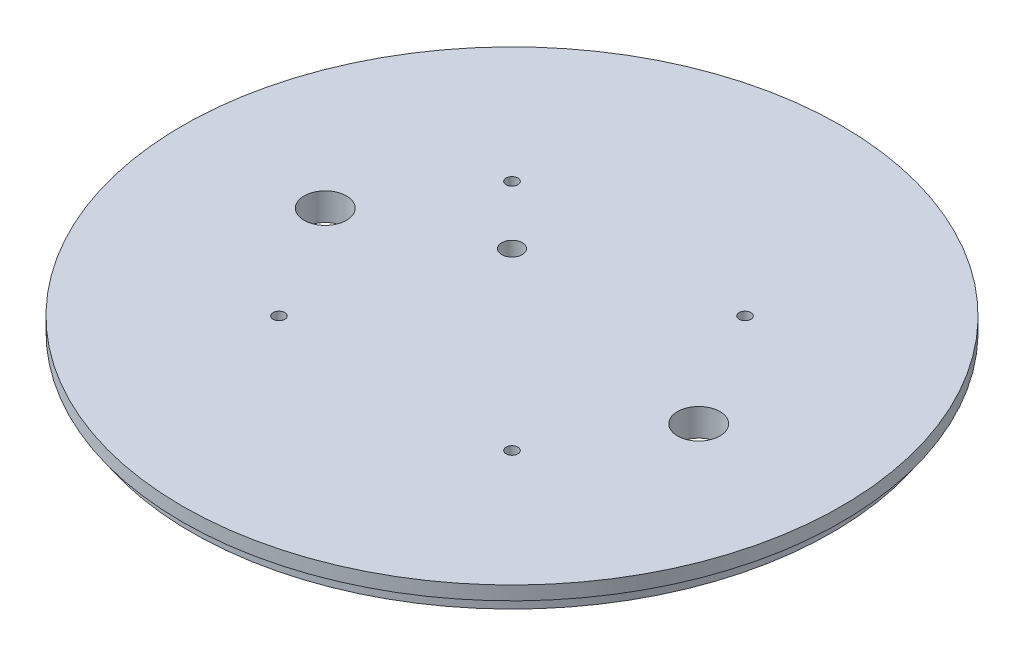
ISO-10303-21;
HEADER;
FILE_DESCRIPTION(('STEP AP214'),'2;1');
FILE_NAME('part.step','',(''),(''),'','','');
FILE_SCHEMA(('AUTOMOTIVE_DESIGN { 1 0 10303 214 1 1 1 1 }'));
ENDSEC;
DATA;
#1=APPLICATION_CONTEXT('core data for automotive mechanical design processes');
#2=APPLICATION_PROTOCOL_DEFINITION('international standard','automotive_design',2000,#1);
#3=PRODUCT_CONTEXT('',#1,'mechanical');
#4=PRODUCT('Part','Part','',(#3));
#5=PRODUCT_RELATED_PRODUCT_CATEGORY('part','',(#4));
#6=PRODUCT_DEFINITION_FORMATION('','',#4);
#7=PRODUCT_DEFINITION_CONTEXT('part definition',#1,'design');
#8=PRODUCT_DEFINITION('design','',#6,#7);
#9=PRODUCT_DEFINITION_SHAPE('','',#8);
#10=(LENGTH_UNIT() NAMED_UNIT(*) SI_UNIT(.MILLI.,.METRE.));
#11=(NAMED_UNIT(*) PLANE_ANGLE_UNIT() SI_UNIT($,.RADIAN.));
#12=(NAMED_UNIT(*) SI_UNIT($,.STERADIAN.) SOLID_ANGLE_UNIT());
#13=UNCERTAINTY_MEASURE_WITH_UNIT(LENGTH_MEASURE(1.E-05),#10,'distance_accuracy_value','');
#14=(GEOMETRIC_REPRESENTATION_CONTEXT(3) GLOBAL_UNCERTAINTY_ASSIGNED_CONTEXT((#13)) GLOBAL_UNIT_ASSIGNED_CONTEXT((#10,
#11,#12)) REPRESENTATION_CONTEXT('',''));
#15=CARTESIAN_POINT('',(0.,0.,0.));
#16=DIRECTION('',(0.,0.,1.));
#17=DIRECTION('',(1.,0.,0.));
#18=AXIS2_PLACEMENT_3D('',#15,#16,#17);
#19=CARTESIAN_POINT('',(0.,6.35,0.));
#20=DIRECTION('',(0.,-1.,0.));
#21=DIRECTION('',(0.,0.,-1.));
#22=AXIS2_PLACEMENT_3D('',#19,#20,#21);
#23=CYLINDRICAL_SURFACE('',#22,76.2);
#24=CARTESIAN_POINT('',(0.,6.35,0.));
#25=DIRECTION('',(0.,1.,0.));
#26=DIRECTION('',(0.,0.,1.));
#27=AXIS2_PLACEMENT_3D('',#24,#25,#26);
#28=CIRCLE('',#27,76.2);
#29=CARTESIAN_POINT('',(0.,6.35,76.2));
#30=VERTEX_POINT('',#29);
#31=EDGE_CURVE('E197',#30,#30,#28,.T.);
#32=ORIENTED_EDGE('',*,*,#31,.F.);
#33=EDGE_LOOP('',(#32));
#34=FACE_BOUND('',#33,.T.);
#35=CARTESIAN_POINT('',(0.,3.175,0.));
#36=DIRECTION('',(0.,-1.,0.));
#37=DIRECTION('',(0.,0.,-1.));
#38=AXIS2_PLACEMENT_3D('',#35,#36,#37);
#39=CIRCLE('',#38,76.2);
#40=CARTESIAN_POINT('',(0.,3.175,-76.2));
#41=VERTEX_POINT('',#40);
#42=EDGE_CURVE('E176',#41,#41,#39,.T.);
#43=ORIENTED_EDGE('',*,*,#42,.F.);
#44=EDGE_LOOP('',(#43));
#45=FACE_BOUND('',#44,.T.);
#46=ADVANCED_FACE('F41',(#34,#45),#23,.T.);
#47=CARTESIAN_POINT('',(0.,0.,0.));
#48=DIRECTION('',(0.,1.,0.));
#49=DIRECTION('',(0.,0.,1.));
#50=AXIS2_PLACEMENT_3D('',#47,#48,#49);
#51=PLANE('',#50);
#52=DIRECTION('',(0.,0.,-1.));
#53=VECTOR('',#52,1.);
#54=CARTESIAN_POINT('',(3.23850000000001,0.,0.));
#55=LINE('',#54,#53);
#56=CARTESIAN_POINT('',(3.23850000000001,0.,-13.97));
#57=VERTEX_POINT('',#56);
#58=CARTESIAN_POINT('',(3.23850000000001,0.,-34.798));
#59=VERTEX_POINT('',#58);
#60=EDGE_CURVE('E50',#57,#59,#55,.T.);
#61=ORIENTED_EDGE('',*,*,#60,.T.);
#62=CARTESIAN_POINT('',(0.,0.,-34.798));
#63=DIRECTION('',(0.,1.,0.));
#64=DIRECTION('',(0.,0.,1.));
#65=AXIS2_PLACEMENT_3D('',#62,#63,#64);
#66=CIRCLE('',#65,3.2385);
#67=CARTESIAN_POINT('',(-3.23849999999999,0.,-34.798));
#68=VERTEX_POINT('',#67);
#69=EDGE_CURVE('E11',#59,#68,#66,.T.);
#70=ORIENTED_EDGE('',*,*,#69,.T.);
#71=DIRECTION('',(0.,0.,1.));
#72=VECTOR('',#71,1.);
#73=CARTESIAN_POINT('',(-3.23849999999999,0.,0.));
#74=LINE('',#73,#72);
#75=CARTESIAN_POINT('',(-3.23849999999999,0.,-13.97));
#76=VERTEX_POINT('',#75);
#77=EDGE_CURVE('E110',#68,#76,#74,.T.);
#78=ORIENTED_EDGE('',*,*,#77,.T.);
#79=CARTESIAN_POINT('',(0.,0.,-13.97));
#80=DIRECTION('',(0.,1.,0.));
#81=DIRECTION('',(0.,0.,1.));
#82=AXIS2_PLACEMENT_3D('',#79,#80,#81);
#83=CIRCLE('',#82,3.2385);
#84=EDGE_CURVE('E261',#76,#57,#83,.T.);
#85=ORIENTED_EDGE('',*,*,#84,.T.);
#86=EDGE_LOOP('',(#61,#70,#78,#85));
#87=FACE_BOUND('',#86,.T.);
#88=DIRECTION('',(0.,0.,1.));
#89=VECTOR('',#88,1.);
#90=CARTESIAN_POINT('',(-3.23850000000005,0.,0.));
#91=LINE('',#90,#89);
#92=CARTESIAN_POINT('',(-3.23850000000005,0.,13.97));
#93=VERTEX_POINT('',#92);
#94=CARTESIAN_POINT('',(-3.23850000000005,0.,34.798));
#95=VERTEX_POINT('',#94);
#96=EDGE_CURVE('E251',#93,#95,#91,.T.);
#97=ORIENTED_EDGE('',*,*,#96,.T.);
#98=CARTESIAN_POINT('',(0.,0.,34.798));
#99=DIRECTION('',(0.,1.,0.));
#100=DIRECTION('',(0.,0.,1.));
#101=AXIS2_PLACEMENT_3D('',#98,#99,#100);
#102=CIRCLE('',#101,3.2385);
#103=CARTESIAN_POINT('',(3.23849999999995,0.,34.798));
#104=VERTEX_POINT('',#103);
#105=EDGE_CURVE('E255',#95,#104,#102,.T.);
#106=ORIENTED_EDGE('',*,*,#105,.T.);
#107=DIRECTION('',(0.,0.,-1.));
#108=VECTOR('',#107,1.);
#109=CARTESIAN_POINT('',(3.23849999999995,0.,0.));
#110=LINE('',#109,#108);
#111=CARTESIAN_POINT('',(3.23849999999995,0.,13.97));
#112=VERTEX_POINT('',#111);
#113=EDGE_CURVE('E217',#104,#112,#110,.T.);
#114=ORIENTED_EDGE('',*,*,#113,.T.);
#115=CARTESIAN_POINT('',(0.,0.,13.97));
#116=DIRECTION('',(0.,1.,0.));
#117=DIRECTION('',(0.,0.,1.));
#118=AXIS2_PLACEMENT_3D('',#115,#116,#117);
#119=CIRCLE('',#118,3.2385);
#120=EDGE_CURVE('E247',#112,#93,#119,.T.);
#121=ORIENTED_EDGE('',*,*,#120,.T.);
#122=EDGE_LOOP('',(#97,#106,#114,#121));
#123=FACE_BOUND('',#122,.T.);
#124=CARTESIAN_POINT('',(-26.9407683632074,0.,26.9407683632075));
#125=DIRECTION('',(0.,1.,0.));
#126=DIRECTION('',(0.,0.,1.));
#127=AXIS2_PLACEMENT_3D('',#124,#125,#126);
#128=CIRCLE('',#127,1.3589);
#129=CARTESIAN_POINT('',(-26.9407683632074,0.,28.2996683632075));
#130=VERTEX_POINT('',#129);
#131=EDGE_CURVE('E189',#130,#130,#128,.F.);
#132=ORIENTED_EDGE('',*,*,#131,.F.);
#133=EDGE_LOOP('',(#132));
#134=FACE_BOUND('',#133,.T.);
#135=CARTESIAN_POINT('',(-13.4703841816037,0.,-13.4703841816038));
#136=DIRECTION('',(0.,1.,0.));
#137=DIRECTION('',(0.,0.,1.));
#138=AXIS2_PLACEMENT_3D('',#135,#136,#137);
#139=CIRCLE('',#138,2.38125);
#140=CARTESIAN_POINT('',(-13.4703841816037,0.,-11.0891341816038));
#141=VERTEX_POINT('',#140);
#142=EDGE_CURVE('E237',#141,#141,#139,.T.);
#143=ORIENTED_EDGE('',*,*,#142,.T.);
#144=EDGE_LOOP('',(#143));
#145=FACE_BOUND('',#144,.T.);
#146=CARTESIAN_POINT('',(-43.18,0.,0.));
#147=DIRECTION('',(0.,1.,0.));
#148=DIRECTION('',(0.,0.,1.));
#149=AXIS2_PLACEMENT_3D('',#146,#147,#148);
#150=CIRCLE('',#149,4.9022);
#151=CARTESIAN_POINT('',(-43.18,0.,4.9022));
#152=VERTEX_POINT('',#151);
#153=EDGE_CURVE('E233',#152,#152,#150,.F.);
#154=ORIENTED_EDGE('',*,*,#153,.F.);
#155=EDGE_LOOP('',(#154));
#156=FACE_BOUND('',#155,.T.);
#157=CARTESIAN_POINT('',(43.18,0.,0.));
#158=DIRECTION('',(0.,1.,0.));
#159=DIRECTION('',(0.,0.,1.));
#160=AXIS2_PLACEMENT_3D('',#157,#158,#159);
#161=CIRCLE('',#160,4.9022);
#162=CARTESIAN_POINT('',(43.18,0.,4.9022));
#163=VERTEX_POINT('',#162);
#164=EDGE_CURVE('E229',#163,#163,#161,.T.);
#165=ORIENTED_EDGE('',*,*,#164,.T.);
#166=EDGE_LOOP('',(#165));
#167=FACE_BOUND('',#166,.T.);
#168=CARTESIAN_POINT('',(-26.9407683632074,0.,-26.9407683632075));
#169=DIRECTION('',(0.,1.,0.));
#170=DIRECTION('',(0.,0.,1.));
#171=AXIS2_PLACEMENT_3D('',#168,#169,#170);
#172=CIRCLE('',#171,1.3589);
#173=CARTESIAN_POINT('',(-26.9407683632074,0.,-25.5818683632075));
#174=VERTEX_POINT('',#173);
#175=EDGE_CURVE('E225',#174,#174,#172,.T.);
#176=ORIENTED_EDGE('',*,*,#175,.T.);
#177=EDGE_LOOP('',(#176));
#178=FACE_BOUND('',#177,.T.);
#179=CARTESIAN_POINT('',(26.9407683632076,0.,26.9407683632073));
#180=DIRECTION('',(0.,1.,0.));
#181=DIRECTION('',(0.,0.,1.));
#182=AXIS2_PLACEMENT_3D('',#179,#180,#181);
#183=CIRCLE('',#182,1.3589);
#184=CARTESIAN_POINT('',(26.9407683632076,0.,28.2996683632073));
#185=VERTEX_POINT('',#184);
#186=EDGE_CURVE('E221',#185,#185,#183,.F.);
#187=ORIENTED_EDGE('',*,*,#186,.F.);
#188=EDGE_LOOP('',(#187));
#189=FACE_BOUND('',#188,.T.);
#190=CARTESIAN_POINT('',(26.9407683632076,0.,-26.9407683632073));
#191=DIRECTION('',(0.,1.,0.));
#192=DIRECTION('',(0.,0.,1.));
#193=AXIS2_PLACEMENT_3D('',#190,#191,#192);
#194=CIRCLE('',#193,1.3589);
#195=CARTESIAN_POINT('',(26.9407683632076,0.,-25.5818683632073));
#196=VERTEX_POINT('',#195);
#197=EDGE_CURVE('E183',#196,#196,#194,.T.);
#198=ORIENTED_EDGE('',*,*,#197,.T.);
#199=EDGE_LOOP('',(#198));
#200=FACE_BOUND('',#199,.T.);
#201=CARTESIAN_POINT('',(0.,0.,0.));
#202=DIRECTION('',(0.,-1.,0.));
#203=DIRECTION('',(0.,0.,-1.));
#204=AXIS2_PLACEMENT_3D('',#201,#202,#203);
#205=CIRCLE('',#204,74.041);
#206=CARTESIAN_POINT('',(0.,0.,-74.041));
#207=VERTEX_POINT('',#206);
#208=EDGE_CURVE('E144',#207,#207,#205,.T.);
#209=ORIENTED_EDGE('',*,*,#208,.T.);
#210=EDGE_LOOP('',(#209));
#211=FACE_BOUND('',#210,.T.);
#212=ADVANCED_FACE('F268',(#87,#123,#134,#145,#156,#167,#178,#189,#200,#211),#51,.F.);
#213=CARTESIAN_POINT('',(-13.4703841816037,6.35,-13.4703841816038));
#214=DIRECTION('',(0.,-1.,0.));
#215=DIRECTION('',(0.,0.,-1.));
#216=AXIS2_PLACEMENT_3D('',#213,#214,#215);
#217=CYLINDRICAL_SURFACE('',#216,2.38125);
#218=CARTESIAN_POINT('',(-13.4703841816037,6.35,-13.4703841816038));
#219=DIRECTION('',(0.,1.,0.));
#220=DIRECTION('',(0.,0.,1.));
#221=AXIS2_PLACEMENT_3D('',#218,#219,#220);
#222=CIRCLE('',#221,2.38125);
#223=CARTESIAN_POINT('',(-13.4703841816037,6.35,-11.0891341816038));
#224=VERTEX_POINT('',#223);
#225=EDGE_CURVE('E209',#224,#224,#222,.T.);
#226=ORIENTED_EDGE('',*,*,#225,.T.);
#227=EDGE_LOOP('',(#226));
#228=FACE_BOUND('',#227,.T.);
#229=ORIENTED_EDGE('',*,*,#142,.F.);
#230=EDGE_LOOP('',(#229));
#231=FACE_BOUND('',#230,.T.);
#232=ADVANCED_FACE('F289',(#228,#231),#217,.F.);
#233=CARTESIAN_POINT('',(-43.18,6.35,0.));
#234=DIRECTION('',(0.,-1.,0.));
#235=DIRECTION('',(0.,0.,-1.));
#236=AXIS2_PLACEMENT_3D('',#233,#234,#235);
#237=CYLINDRICAL_SURFACE('',#236,4.9022);
#238=CARTESIAN_POINT('',(-43.18,6.35,0.));
#239=DIRECTION('',(0.,1.,0.));
#240=DIRECTION('',(0.,0.,1.));
#241=AXIS2_PLACEMENT_3D('',#238,#239,#240);
#242=CIRCLE('',#241,4.9022);
#243=CARTESIAN_POINT('',(-43.18,6.35,4.9022));
#244=VERTEX_POINT('',#243);
#245=EDGE_CURVE('E205',#244,#244,#242,.F.);
#246=ORIENTED_EDGE('',*,*,#245,.F.);
#247=EDGE_LOOP('',(#246));
#248=FACE_BOUND('',#247,.T.);
#249=ORIENTED_EDGE('',*,*,#153,.T.);
#250=EDGE_LOOP('',(#249));
#251=FACE_BOUND('',#250,.T.);
#252=ADVANCED_FACE('F342',(#248,#251),#237,.F.);
#253=CARTESIAN_POINT('',(43.18,6.35,0.));
#254=DIRECTION('',(0.,-1.,0.));
#255=DIRECTION('',(0.,0.,-1.));
#256=AXIS2_PLACEMENT_3D('',#253,#254,#255);
#257=CYLINDRICAL_SURFACE('',#256,4.9022);
#258=CARTESIAN_POINT('',(43.18,6.35,0.));
#259=DIRECTION('',(0.,1.,0.));
#260=DIRECTION('',(0.,0.,1.));
#261=AXIS2_PLACEMENT_3D('',#258,#259,#260);
#262=CIRCLE('',#261,4.9022);
#263=CARTESIAN_POINT('',(43.18,6.35,4.9022));
#264=VERTEX_POINT('',#263);
#265=EDGE_CURVE('E201',#264,#264,#262,.T.);
#266=ORIENTED_EDGE('',*,*,#265,.T.);
#267=EDGE_LOOP('',(#266));
#268=FACE_BOUND('',#267,.T.);
#269=ORIENTED_EDGE('',*,*,#164,.F.);
#270=EDGE_LOOP('',(#269));
#271=FACE_BOUND('',#270,.T.);
#272=ADVANCED_FACE('F295',(#268,#271),#257,.F.);
#273=CARTESIAN_POINT('',(-26.9407683632074,6.35,-26.9407683632075));
#274=DIRECTION('',(0.,-1.,0.));
#275=DIRECTION('',(0.,0.,-1.));
#276=AXIS2_PLACEMENT_3D('',#273,#274,#275);
#277=CYLINDRICAL_SURFACE('',#276,1.3589);
#278=CARTESIAN_POINT('',(-26.9407683632074,6.35,-26.9407683632075));
#279=DIRECTION('',(0.,1.,0.));
#280=DIRECTION('',(0.,0.,1.));
#281=AXIS2_PLACEMENT_3D('',#278,#279,#280);
#282=CIRCLE('',#281,1.3589);
#283=CARTESIAN_POINT('',(-26.9407683632074,6.35,-25.5818683632075));
#284=VERTEX_POINT('',#283);
#285=EDGE_CURVE('E193',#284,#284,#282,.T.);
#286=ORIENTED_EDGE('',*,*,#285,.T.);
#287=EDGE_LOOP('',(#286));
#288=FACE_BOUND('',#287,.T.);
#289=ORIENTED_EDGE('',*,*,#175,.F.);
#290=EDGE_LOOP('',(#289));
#291=FACE_BOUND('',#290,.T.);
#292=ADVANCED_FACE('F297',(#288,#291),#277,.F.);
#293=CARTESIAN_POINT('',(26.9407683632076,6.35,26.9407683632073));
#294=DIRECTION('',(0.,-1.,0.));
#295=DIRECTION('',(0.,0.,-1.));
#296=AXIS2_PLACEMENT_3D('',#293,#294,#295);
#297=CYLINDRICAL_SURFACE('',#296,1.3589);
#298=CARTESIAN_POINT('',(26.9407683632076,6.35,26.9407683632073));
#299=DIRECTION('',(0.,1.,0.));
#300=DIRECTION('',(0.,0.,1.));
#301=AXIS2_PLACEMENT_3D('',#298,#299,#300);
#302=CIRCLE('',#301,1.3589);
#303=CARTESIAN_POINT('',(26.9407683632076,6.35,28.2996683632073));
#304=VERTEX_POINT('',#303);
#305=EDGE_CURVE('E188',#304,#304,#302,.F.);
#306=ORIENTED_EDGE('',*,*,#305,.F.);
#307=EDGE_LOOP('',(#306));
#308=FACE_BOUND('',#307,.T.);
#309=ORIENTED_EDGE('',*,*,#186,.T.);
#310=EDGE_LOOP('',(#309));
#311=FACE_BOUND('',#310,.T.);
#312=ADVANCED_FACE('F299',(#308,#311),#297,.F.);
#313=CARTESIAN_POINT('',(26.9407683632076,6.35,-26.9407683632073));
#314=DIRECTION('',(0.,-1.,0.));
#315=DIRECTION('',(0.,0.,-1.));
#316=AXIS2_PLACEMENT_3D('',#313,#314,#315);
#317=CYLINDRICAL_SURFACE('',#316,1.3589);
#318=CARTESIAN_POINT('',(26.9407683632076,6.35,-26.9407683632073));
#319=DIRECTION('',(0.,1.,0.));
#320=DIRECTION('',(0.,0.,1.));
#321=AXIS2_PLACEMENT_3D('',#318,#319,#320);
#322=CIRCLE('',#321,1.3589);
#323=CARTESIAN_POINT('',(26.9407683632076,6.35,-25.5818683632073));
#324=VERTEX_POINT('',#323);
#325=EDGE_CURVE('E184',#324,#324,#322,.T.);
#326=ORIENTED_EDGE('',*,*,#325,.T.);
#327=EDGE_LOOP('',(#326));
#328=FACE_BOUND('',#327,.T.);
#329=ORIENTED_EDGE('',*,*,#197,.F.);
#330=EDGE_LOOP('',(#329));
#331=FACE_BOUND('',#330,.T.);
#332=ADVANCED_FACE('F43',(#328,#331),#317,.F.);
#333=CARTESIAN_POINT('',(-26.9407683632074,6.35,26.9407683632075));
#334=DIRECTION('',(0.,-1.,0.));
#335=DIRECTION('',(0.,0.,-1.));
#336=AXIS2_PLACEMENT_3D('',#333,#334,#335);
#337=CYLINDRICAL_SURFACE('',#336,1.3589);
#338=CARTESIAN_POINT('',(-26.9407683632074,6.35,26.9407683632075));
#339=DIRECTION('',(0.,1.,0.));
#340=DIRECTION('',(0.,0.,1.));
#341=AXIS2_PLACEMENT_3D('',#338,#339,#340);
#342=CIRCLE('',#341,1.3589);
#343=CARTESIAN_POINT('',(-26.9407683632074,6.35,28.2996683632075));
#344=VERTEX_POINT('',#343);
#345=EDGE_CURVE('E213',#344,#344,#342,.F.);
#346=ORIENTED_EDGE('',*,*,#345,.F.);
#347=EDGE_LOOP('',(#346));
#348=FACE_BOUND('',#347,.T.);
#349=ORIENTED_EDGE('',*,*,#131,.T.);
#350=EDGE_LOOP('',(#349));
#351=FACE_BOUND('',#350,.T.);
#352=ADVANCED_FACE('F306',(#348,#351),#337,.F.);
#353=CARTESIAN_POINT('',(0.,6.35,0.));
#354=DIRECTION('',(0.,1.,0.));
#355=DIRECTION('',(0.,0.,1.));
#356=AXIS2_PLACEMENT_3D('',#353,#354,#355);
#357=PLANE('',#356);
#358=ORIENTED_EDGE('',*,*,#325,.F.);
#359=EDGE_LOOP('',(#358));
#360=FACE_BOUND('',#359,.T.);
#361=ORIENTED_EDGE('',*,*,#305,.T.);
#362=EDGE_LOOP('',(#361));
#363=FACE_BOUND('',#362,.T.);
#364=ORIENTED_EDGE('',*,*,#285,.F.);
#365=EDGE_LOOP('',(#364));
#366=FACE_BOUND('',#365,.T.);
#367=ORIENTED_EDGE('',*,*,#31,.T.);
#368=EDGE_LOOP('',(#367));
#369=FACE_BOUND('',#368,.T.);
#370=ORIENTED_EDGE('',*,*,#265,.F.);
#371=EDGE_LOOP('',(#370));
#372=FACE_BOUND('',#371,.T.);
#373=ORIENTED_EDGE('',*,*,#245,.T.);
#374=EDGE_LOOP('',(#373));
#375=FACE_BOUND('',#374,.T.);
#376=ORIENTED_EDGE('',*,*,#225,.F.);
#377=EDGE_LOOP('',(#376));
#378=FACE_BOUND('',#377,.T.);
#379=ORIENTED_EDGE('',*,*,#345,.T.);
#380=EDGE_LOOP('',(#379));
#381=FACE_BOUND('',#380,.T.);
#382=ADVANCED_FACE('F330',(#360,#363,#366,#369,#372,#375,#378,#381),#357,.T.);
#383=CARTESIAN_POINT('',(0.,3.175,0.));
#384=DIRECTION('',(0.,-1.,0.));
#385=DIRECTION('',(0.,0.,-1.));
#386=AXIS2_PLACEMENT_3D('',#383,#384,#385);
#387=PLANE('',#386);
#388=CARTESIAN_POINT('',(0.,3.175,0.));
#389=DIRECTION('',(0.,-1.,0.));
#390=DIRECTION('',(0.,0.,-1.));
#391=AXIS2_PLACEMENT_3D('',#388,#389,#390);
#392=CIRCLE('',#391,74.041);
#393=CARTESIAN_POINT('',(0.,3.175,-74.041));
#394=VERTEX_POINT('',#393);
#395=EDGE_CURVE('E172',#394,#394,#392,.T.);
#396=ORIENTED_EDGE('',*,*,#395,.F.);
#397=EDGE_LOOP('',(#396));
#398=FACE_BOUND('',#397,.T.);
#399=ORIENTED_EDGE('',*,*,#42,.T.);
#400=EDGE_LOOP('',(#399));
#401=FACE_BOUND('',#400,.T.);
#402=ADVANCED_FACE('F320',(#398,#401),#387,.T.);
#403=CARTESIAN_POINT('',(0.,3.175,0.));
#404=DIRECTION('',(0.,-1.,0.));
#405=DIRECTION('',(0.,0.,-1.));
#406=AXIS2_PLACEMENT_3D('',#403,#404,#405);
#407=CYLINDRICAL_SURFACE('',#406,74.041);
#408=ORIENTED_EDGE('',*,*,#395,.T.);
#409=EDGE_LOOP('',(#408));
#410=FACE_BOUND('',#409,.T.);
#411=ORIENTED_EDGE('',*,*,#208,.F.);
#412=EDGE_LOOP('',(#411));
#413=FACE_BOUND('',#412,.T.);
#414=ADVANCED_FACE('F317',(#410,#413),#407,.T.);
#415=CARTESIAN_POINT('',(0.,-0.381,34.798));
#416=DIRECTION('',(0.,1.,0.));
#417=DIRECTION('',(0.,0.,1.));
#418=AXIS2_PLACEMENT_3D('',#415,#416,#417);
#419=CYLINDRICAL_SURFACE('',#418,3.2385);
#420=DIRECTION('',(0.,1.,0.));
#421=VECTOR('',#420,1.);
#422=CARTESIAN_POINT('',(-3.23850000000005,-0.381,34.798));
#423=LINE('',#422,#421);
#424=CARTESIAN_POINT('',(-3.23850000000005,3.175,34.798));
#425=VERTEX_POINT('',#424);
#426=EDGE_CURVE('E131',#95,#425,#423,.T.);
#427=ORIENTED_EDGE('',*,*,#426,.T.);
#428=CARTESIAN_POINT('',(0.,3.175,34.798));
#429=DIRECTION('',(0.,1.,0.));
#430=DIRECTION('',(0.,0.,-1.));
#431=AXIS2_PLACEMENT_3D('',#428,#429,#430);
#432=CIRCLE('',#431,3.2385);
#433=CARTESIAN_POINT('',(3.23849999999995,3.175,34.798));
#434=VERTEX_POINT('',#433);
#435=EDGE_CURVE('E150',#425,#434,#432,.T.);
#436=ORIENTED_EDGE('',*,*,#435,.T.);
#437=DIRECTION('',(0.,1.,0.));
#438=VECTOR('',#437,1.);
#439=CARTESIAN_POINT('',(3.23849999999995,-0.381,34.798));
#440=LINE('',#439,#438);
#441=EDGE_CURVE('E164',#104,#434,#440,.T.);
#442=ORIENTED_EDGE('',*,*,#441,.F.);
#443=ORIENTED_EDGE('',*,*,#105,.F.);
#444=EDGE_LOOP('',(#427,#436,#442,#443));
#445=FACE_BOUND('',#444,.T.);
#446=ADVANCED_FACE('F319',(#445),#419,.F.);
#447=CARTESIAN_POINT('',(-3.23850000000005,-0.381,34.798));
#448=DIRECTION('',(-1.,0.,0.));
#449=DIRECTION('',(0.,0.,1.));
#450=AXIS2_PLACEMENT_3D('',#447,#448,#449);
#451=PLANE('',#450);
#452=DIRECTION('',(0.,1.,0.));
#453=VECTOR('',#452,1.);
#454=CARTESIAN_POINT('',(-3.23850000000005,-0.381,13.97));
#455=LINE('',#454,#453);
#456=CARTESIAN_POINT('',(-3.23850000000005,3.175,13.97));
#457=VERTEX_POINT('',#456);
#458=EDGE_CURVE('E135',#93,#457,#455,.T.);
#459=ORIENTED_EDGE('',*,*,#458,.T.);
#460=DIRECTION('',(0.,0.,1.));
#461=VECTOR('',#460,1.);
#462=CARTESIAN_POINT('',(-3.23850000000005,3.175,34.798));
#463=LINE('',#462,#461);
#464=EDGE_CURVE('E161',#457,#425,#463,.T.);
#465=ORIENTED_EDGE('',*,*,#464,.T.);
#466=ORIENTED_EDGE('',*,*,#426,.F.);
#467=ORIENTED_EDGE('',*,*,#96,.F.);
#468=EDGE_LOOP('',(#459,#465,#466,#467));
#469=FACE_BOUND('',#468,.T.);
#470=ADVANCED_FACE('F327',(#469),#451,.F.);
#471=CARTESIAN_POINT('',(0.,-0.381,13.97));
#472=DIRECTION('',(0.,1.,0.));
#473=DIRECTION('',(0.,0.,1.));
#474=AXIS2_PLACEMENT_3D('',#471,#472,#473);
#475=CYLINDRICAL_SURFACE('',#474,3.2385);
#476=DIRECTION('',(0.,1.,0.));
#477=VECTOR('',#476,1.);
#478=CARTESIAN_POINT('',(3.23849999999995,-0.381,13.97));
#479=LINE('',#478,#477);
#480=CARTESIAN_POINT('',(3.23849999999995,3.175,13.97));
#481=VERTEX_POINT('',#480);
#482=EDGE_CURVE('E65',#112,#481,#479,.T.);
#483=ORIENTED_EDGE('',*,*,#482,.T.);
#484=CARTESIAN_POINT('',(0.,3.175,13.97));
#485=DIRECTION('',(0.,1.,0.));
#486=DIRECTION('',(0.,0.,-1.));
#487=AXIS2_PLACEMENT_3D('',#484,#485,#486);
#488=CIRCLE('',#487,3.2385);
#489=EDGE_CURVE('E157',#481,#457,#488,.T.);
#490=ORIENTED_EDGE('',*,*,#489,.T.);
#491=ORIENTED_EDGE('',*,*,#458,.F.);
#492=ORIENTED_EDGE('',*,*,#120,.F.);
#493=EDGE_LOOP('',(#483,#490,#491,#492));
#494=FACE_BOUND('',#493,.T.);
#495=ADVANCED_FACE('F444',(#494),#475,.F.);
#496=CARTESIAN_POINT('',(3.23849999999995,-0.381,34.798));
#497=DIRECTION('',(1.,0.,0.));
#498=DIRECTION('',(0.,0.,-1.));
#499=AXIS2_PLACEMENT_3D('',#496,#497,#498);
#500=PLANE('',#499);
#501=ORIENTED_EDGE('',*,*,#441,.T.);
#502=DIRECTION('',(0.,0.,-1.));
#503=VECTOR('',#502,1.);
#504=CARTESIAN_POINT('',(3.23849999999995,3.175,34.798));
#505=LINE('',#504,#503);
#506=EDGE_CURVE('E154',#434,#481,#505,.T.);
#507=ORIENTED_EDGE('',*,*,#506,.T.);
#508=ORIENTED_EDGE('',*,*,#482,.F.);
#509=ORIENTED_EDGE('',*,*,#113,.F.);
#510=EDGE_LOOP('',(#501,#507,#508,#509));
#511=FACE_BOUND('',#510,.T.);
#512=ADVANCED_FACE('F455',(#511),#500,.F.);
#513=CARTESIAN_POINT('',(0.,3.175,34.798));
#514=DIRECTION('',(0.,-1.,0.));
#515=DIRECTION('',(0.,0.,-1.));
#516=AXIS2_PLACEMENT_3D('',#513,#514,#515);
#517=PLANE('',#516);
#518=ORIENTED_EDGE('',*,*,#435,.F.);
#519=ORIENTED_EDGE('',*,*,#464,.F.);
#520=ORIENTED_EDGE('',*,*,#489,.F.);
#521=ORIENTED_EDGE('',*,*,#506,.F.);
#522=EDGE_LOOP('',(#518,#519,#520,#521));
#523=FACE_BOUND('',#522,.T.);
#524=ADVANCED_FACE('F466',(#523),#517,.T.);
#525=CARTESIAN_POINT('',(0.,-0.381,-34.798));
#526=DIRECTION('',(0.,1.,0.));
#527=DIRECTION('',(0.,0.,1.));
#528=AXIS2_PLACEMENT_3D('',#525,#526,#527);
#529=CYLINDRICAL_SURFACE('',#528,3.2385);
#530=DIRECTION('',(0.,1.,0.));
#531=VECTOR('',#530,1.);
#532=CARTESIAN_POINT('',(3.23850000000001,-0.381,-34.798));
#533=LINE('',#532,#531);
#534=CARTESIAN_POINT('',(3.23850000000001,3.175,-34.798));
#535=VERTEX_POINT('',#534);
#536=EDGE_CURVE('E129',#59,#535,#533,.T.);
#537=ORIENTED_EDGE('',*,*,#536,.T.);
#538=CARTESIAN_POINT('',(0.,3.175,-34.798));
#539=DIRECTION('',(0.,1.,0.));
#540=DIRECTION('',(0.,0.,1.));
#541=AXIS2_PLACEMENT_3D('',#538,#539,#540);
#542=CIRCLE('',#541,3.2385);
#543=CARTESIAN_POINT('',(-3.23849999999999,3.175,-34.798));
#544=VERTEX_POINT('',#543);
#545=EDGE_CURVE('E121',#535,#544,#542,.T.);
#546=ORIENTED_EDGE('',*,*,#545,.T.);
#547=DIRECTION('',(0.,1.,0.));
#548=VECTOR('',#547,1.);
#549=CARTESIAN_POINT('',(-3.23849999999999,-0.381,-34.798));
#550=LINE('',#549,#548);
#551=EDGE_CURVE('E105',#68,#544,#550,.T.);
#552=ORIENTED_EDGE('',*,*,#551,.F.);
#553=ORIENTED_EDGE('',*,*,#69,.F.);
#554=EDGE_LOOP('',(#537,#546,#552,#553));
#555=FACE_BOUND('',#554,.T.);
#556=ADVANCED_FACE('F127',(#555),#529,.F.);
#557=CARTESIAN_POINT('',(3.23850000000001,-0.381,-34.798));
#558=DIRECTION('',(1.,0.,0.));
#559=DIRECTION('',(0.,0.,-1.));
#560=AXIS2_PLACEMENT_3D('',#557,#558,#559);
#561=PLANE('',#560);
#562=DIRECTION('',(0.,1.,0.));
#563=VECTOR('',#562,1.);
#564=CARTESIAN_POINT('',(3.23850000000001,-0.381,-13.97));
#565=LINE('',#564,#563);
#566=CARTESIAN_POINT('',(3.23850000000001,3.175,-13.97));
#567=VERTEX_POINT('',#566);
#568=EDGE_CURVE('E145',#57,#567,#565,.T.);
#569=ORIENTED_EDGE('',*,*,#568,.T.);
#570=DIRECTION('',(0.,0.,-1.));
#571=VECTOR('',#570,1.);
#572=CARTESIAN_POINT('',(3.23850000000001,3.175,-34.798));
#573=LINE('',#572,#571);
#574=EDGE_CURVE('E114',#567,#535,#573,.T.);
#575=ORIENTED_EDGE('',*,*,#574,.T.);
#576=ORIENTED_EDGE('',*,*,#536,.F.);
#577=ORIENTED_EDGE('',*,*,#60,.F.);
#578=EDGE_LOOP('',(#569,#575,#576,#577));
#579=FACE_BOUND('',#578,.T.);
#580=ADVANCED_FACE('F272',(#579),#561,.F.);
#581=CARTESIAN_POINT('',(0.,-0.381,-13.97));
#582=DIRECTION('',(0.,1.,0.));
#583=DIRECTION('',(0.,0.,1.));
#584=AXIS2_PLACEMENT_3D('',#581,#582,#583);
#585=CYLINDRICAL_SURFACE('',#584,3.2385);
#586=DIRECTION('',(0.,1.,0.));
#587=VECTOR('',#586,1.);
#588=CARTESIAN_POINT('',(-3.23849999999999,-0.381,-13.97));
#589=LINE('',#588,#587);
#590=CARTESIAN_POINT('',(-3.23849999999999,3.175,-13.97));
#591=VERTEX_POINT('',#590);
#592=EDGE_CURVE('E57',#76,#591,#589,.T.);
#593=ORIENTED_EDGE('',*,*,#592,.T.);
#594=CARTESIAN_POINT('',(0.,3.175,-13.97));
#595=DIRECTION('',(0.,1.,0.));
#596=DIRECTION('',(0.,0.,1.));
#597=AXIS2_PLACEMENT_3D('',#594,#595,#596);
#598=CIRCLE('',#597,3.2385);
#599=EDGE_CURVE('E124',#591,#567,#598,.T.);
#600=ORIENTED_EDGE('',*,*,#599,.T.);
#601=ORIENTED_EDGE('',*,*,#568,.F.);
#602=ORIENTED_EDGE('',*,*,#84,.F.);
#603=EDGE_LOOP('',(#593,#600,#601,#602));
#604=FACE_BOUND('',#603,.T.);
#605=ADVANCED_FACE('F274',(#604),#585,.F.);
#606=CARTESIAN_POINT('',(-3.23849999999999,-0.381,-34.798));
#607=DIRECTION('',(-1.,0.,0.));
#608=DIRECTION('',(0.,0.,1.));
#609=AXIS2_PLACEMENT_3D('',#606,#607,#608);
#610=PLANE('',#609);
#611=ORIENTED_EDGE('',*,*,#551,.T.);
#612=DIRECTION('',(0.,0.,1.));
#613=VECTOR('',#612,1.);
#614=CARTESIAN_POINT('',(-3.23849999999999,3.175,-34.798));
#615=LINE('',#614,#613);
#616=EDGE_CURVE('E108',#544,#591,#615,.T.);
#617=ORIENTED_EDGE('',*,*,#616,.T.);
#618=ORIENTED_EDGE('',*,*,#592,.F.);
#619=ORIENTED_EDGE('',*,*,#77,.F.);
#620=EDGE_LOOP('',(#611,#617,#618,#619));
#621=FACE_BOUND('',#620,.T.);
#622=ADVANCED_FACE('F107',(#621),#610,.F.);
#623=CARTESIAN_POINT('',(0.,3.175,-34.798));
#624=DIRECTION('',(0.,1.,0.));
#625=DIRECTION('',(0.,0.,1.));
#626=AXIS2_PLACEMENT_3D('',#623,#624,#625);
#627=PLANE('',#626);
#628=ORIENTED_EDGE('',*,*,#545,.F.);
#629=ORIENTED_EDGE('',*,*,#574,.F.);
#630=ORIENTED_EDGE('',*,*,#599,.F.);
#631=ORIENTED_EDGE('',*,*,#616,.F.);
#632=EDGE_LOOP('',(#628,#629,#630,#631));
#633=FACE_BOUND('',#632,.T.);
#634=ADVANCED_FACE('F119',(#633),#627,.F.);
#635=CLOSED_SHELL('',(#46,#212,#232,#252,#272,#292,#312,#332,#352,#382,#402,#414,#446,#470,#495,
#512,#524,#556,#580,#605,#622,#634));
#636=MANIFOLD_SOLID_BREP('B2',#635);
#637=ADVANCED_BREP_SHAPE_REPRESENTATION('',(#18,#636),#14);
#638=SHAPE_DEFINITION_REPRESENTATION(#9,#637);
ENDSEC;
END-ISO-10303-21;
